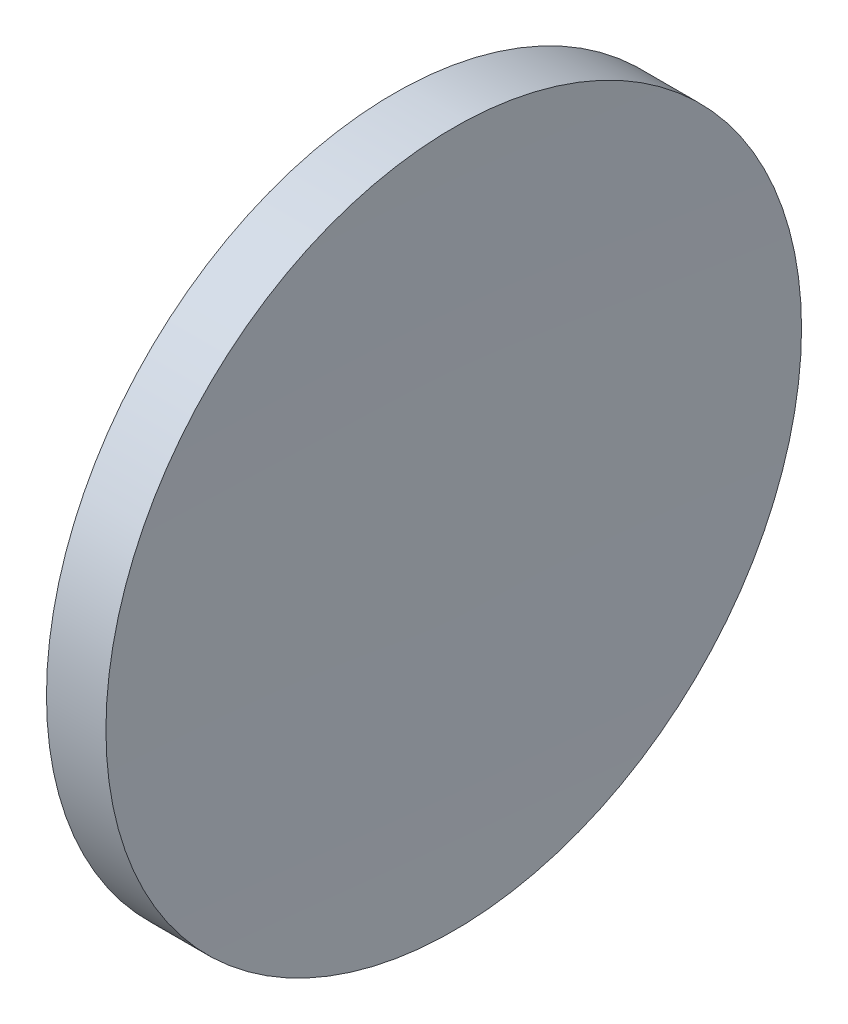
ISO-10303-21;
HEADER;
FILE_DESCRIPTION(('STEP AP214'),'2;1');
FILE_NAME('part.step','',(''),(''),'','','');
FILE_SCHEMA(('AUTOMOTIVE_DESIGN { 1 0 10303 214 1 1 1 1 }'));
ENDSEC;
DATA;
#1=APPLICATION_CONTEXT('core data for automotive mechanical design processes');
#2=APPLICATION_PROTOCOL_DEFINITION('international standard','automotive_design',2000,#1);
#3=PRODUCT_CONTEXT('',#1,'mechanical');
#4=PRODUCT('Part','Part','',(#3));
#5=PRODUCT_RELATED_PRODUCT_CATEGORY('part','',(#4));
#6=PRODUCT_DEFINITION_FORMATION('','',#4);
#7=PRODUCT_DEFINITION_CONTEXT('part definition',#1,'design');
#8=PRODUCT_DEFINITION('design','',#6,#7);
#9=PRODUCT_DEFINITION_SHAPE('','',#8);
#10=(LENGTH_UNIT() NAMED_UNIT(*) SI_UNIT(.MILLI.,.METRE.));
#11=(NAMED_UNIT(*) PLANE_ANGLE_UNIT() SI_UNIT($,.RADIAN.));
#12=(NAMED_UNIT(*) SI_UNIT($,.STERADIAN.) SOLID_ANGLE_UNIT());
#13=UNCERTAINTY_MEASURE_WITH_UNIT(LENGTH_MEASURE(1.E-05),#10,'distance_accuracy_value','');
#14=(GEOMETRIC_REPRESENTATION_CONTEXT(3) GLOBAL_UNCERTAINTY_ASSIGNED_CONTEXT((#13)) GLOBAL_UNIT_ASSIGNED_CONTEXT((#10,
#11,#12)) REPRESENTATION_CONTEXT('',''));
#15=CARTESIAN_POINT('',(0.,0.,0.));
#16=DIRECTION('',(0.,0.,1.));
#17=DIRECTION('',(1.,0.,0.));
#18=AXIS2_PLACEMENT_3D('',#15,#16,#17);
#19=CARTESIAN_POINT('',(576.032002223196,32.6107681292268,0.588114432534932));
#20=DIRECTION('',(0.,-1.,0.));
#21=DIRECTION('',(0.,0.,1.));
#22=AXIS2_PLACEMENT_3D('',#19,#20,#21);
#23=CIRCLE('',#22,516.5);
#24=TRIMMED_CURVE('',#23,(PARAMETER_VALUE(-1.57193498034692)),
(PARAMETER_VALUE(1.57193498034692)),.T.,.PARAMETER.);
#25=CARTESIAN_POINT('',(576.032002223196,32.6107681292268,0.));
#26=DIRECTION('',(-1.,0.,0.));
#27=AXIS1_PLACEMENT('',#25,#26);
#28=SURFACE_OF_REVOLUTION('',#24,#27);
#29=CARTESIAN_POINT('',(59.6693806264857,32.6107681292268,0.));
#30=DIRECTION('',(-1.,0.,0.));
#31=DIRECTION('',(0.,0.,1.));
#32=AXIS2_PLACEMENT_3D('',#29,#30,#31);
#33=CIRCLE('',#32,12.5);
#34=CARTESIAN_POINT('',(59.6693806264857,32.6107681292268,12.5));
#35=VERTEX_POINT('',#34);
#36=EDGE_CURVE('E11',#35,#35,#33,.T.);
#37=ORIENTED_EDGE('',*,*,#36,.F.);
#38=EDGE_LOOP('',(#37));
#39=FACE_BOUND('',#38,.T.);
#40=CARTESIAN_POINT('',(59.5323370525263,32.6107681292268,0.));
#41=VERTEX_POINT('',#40);
#42=VERTEX_LOOP('',#41);
#43=FACE_BOUND('',#42,.T.);
#44=ADVANCED_FACE('F37',(#39,#43),#28,.F.);
#45=CARTESIAN_POINT('',(56.1009150799972,32.6107681292268,0.));
#46=DIRECTION('',(-1.,0.,0.));
#47=DIRECTION('',(0.,0.,1.));
#48=AXIS2_PLACEMENT_3D('',#45,#46,#47);
#49=CYLINDRICAL_SURFACE('',#48,12.5);
#50=CARTESIAN_POINT('',(57.5323370525261,32.6107681292268,0.));
#51=DIRECTION('',(-1.,0.,0.));
#52=DIRECTION('',(0.,0.,1.));
#53=AXIS2_PLACEMENT_3D('',#50,#51,#52);
#54=CIRCLE('',#53,12.5);
#55=CARTESIAN_POINT('',(57.5323370525261,32.6107681292268,12.5));
#56=VERTEX_POINT('',#55);
#57=EDGE_CURVE('E43',#56,#56,#54,.T.);
#58=ORIENTED_EDGE('',*,*,#57,.F.);
#59=EDGE_LOOP('',(#58));
#60=FACE_BOUND('',#59,.T.);
#61=ORIENTED_EDGE('',*,*,#36,.T.);
#62=EDGE_LOOP('',(#61));
#63=FACE_BOUND('',#62,.T.);
#64=ADVANCED_FACE('F47',(#60,#63),#49,.T.);
#65=CARTESIAN_POINT('',(57.5323370525261,32.6107681292268,0.));
#66=DIRECTION('',(1.,0.,0.));
#67=DIRECTION('',(0.,0.,-1.));
#68=AXIS2_PLACEMENT_3D('',#65,#66,#67);
#69=PLANE('',#68);
#70=ORIENTED_EDGE('',*,*,#57,.T.);
#71=EDGE_LOOP('',(#70));
#72=FACE_BOUND('',#71,.T.);
#73=ADVANCED_FACE('F52',(#72),#69,.F.);
#74=CLOSED_SHELL('',(#44,#64,#73));
#75=MANIFOLD_SOLID_BREP('B2',#74);
#76=ADVANCED_BREP_SHAPE_REPRESENTATION('',(#18,#75),#14);
#77=SHAPE_DEFINITION_REPRESENTATION(#9,#76);
ENDSEC;
END-ISO-10303-21;
